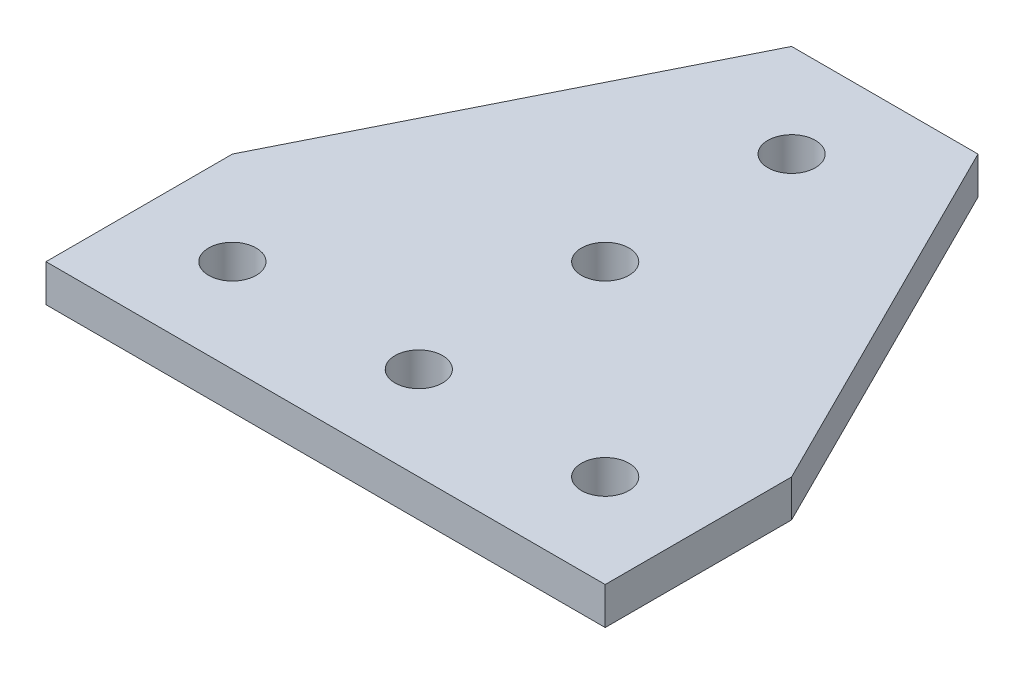
ISO-10303-21;
HEADER;
FILE_DESCRIPTION(('STEP AP214'),'2;1');
FILE_NAME('part.step','',(''),(''),'','','');
FILE_SCHEMA(('AUTOMOTIVE_DESIGN { 1 0 10303 214 1 1 1 1 }'));
ENDSEC;
DATA;
#1=APPLICATION_CONTEXT('core data for automotive mechanical design processes');
#2=APPLICATION_PROTOCOL_DEFINITION('international standard','automotive_design',2000,#1);
#3=PRODUCT_CONTEXT('',#1,'mechanical');
#4=PRODUCT('Part','Part','',(#3));
#5=PRODUCT_RELATED_PRODUCT_CATEGORY('part','',(#4));
#6=PRODUCT_DEFINITION_FORMATION('','',#4);
#7=PRODUCT_DEFINITION_CONTEXT('part definition',#1,'design');
#8=PRODUCT_DEFINITION('design','',#6,#7);
#9=PRODUCT_DEFINITION_SHAPE('','',#8);
#10=(LENGTH_UNIT() NAMED_UNIT(*) SI_UNIT(.MILLI.,.METRE.));
#11=(NAMED_UNIT(*) PLANE_ANGLE_UNIT() SI_UNIT($,.RADIAN.));
#12=(NAMED_UNIT(*) SI_UNIT($,.STERADIAN.) SOLID_ANGLE_UNIT());
#13=UNCERTAINTY_MEASURE_WITH_UNIT(LENGTH_MEASURE(1.E-05),#10,'distance_accuracy_value','');
#14=(GEOMETRIC_REPRESENTATION_CONTEXT(3) GLOBAL_UNCERTAINTY_ASSIGNED_CONTEXT((#13)) GLOBAL_UNIT_ASSIGNED_CONTEXT((#10,
#11,#12)) REPRESENTATION_CONTEXT('',''));
#15=CARTESIAN_POINT('',(0.,0.,0.));
#16=DIRECTION('',(0.,0.,1.));
#17=DIRECTION('',(1.,0.,0.));
#18=AXIS2_PLACEMENT_3D('',#15,#16,#17);
#19=CARTESIAN_POINT('',(0.,4.,0.));
#20=DIRECTION('',(0.,-1.,0.));
#21=DIRECTION('',(0.,0.,-1.));
#22=AXIS2_PLACEMENT_3D('',#19,#20,#21);
#23=PLANE('',#22);
#24=CARTESIAN_POINT('',(0.,4.,-20.));
#25=DIRECTION('',(0.,1.,0.));
#26=DIRECTION('',(0.,0.,1.));
#27=AXIS2_PLACEMENT_3D('',#24,#25,#26);
#28=CIRCLE('',#27,2.55);
#29=CARTESIAN_POINT('',(0.,4.,-17.45));
#30=VERTEX_POINT('',#29);
#31=EDGE_CURVE('E195',#30,#30,#28,.T.);
#32=ORIENTED_EDGE('',*,*,#31,.F.);
#33=EDGE_LOOP('',(#32));
#34=FACE_BOUND('',#33,.T.);
#35=CARTESIAN_POINT('',(20.,4.,0.));
#36=DIRECTION('',(0.,1.,0.));
#37=DIRECTION('',(0.,0.,1.));
#38=AXIS2_PLACEMENT_3D('',#35,#36,#37);
#39=CIRCLE('',#38,2.55);
#40=CARTESIAN_POINT('',(20.,4.,2.55));
#41=VERTEX_POINT('',#40);
#42=EDGE_CURVE('E207',#41,#41,#39,.T.);
#43=ORIENTED_EDGE('',*,*,#42,.F.);
#44=EDGE_LOOP('',(#43));
#45=FACE_BOUND('',#44,.T.);
#46=DIRECTION('',(0.,0.,-1.));
#47=VECTOR('',#46,1.);
#48=CARTESIAN_POINT('',(30.,4.,10.));
#49=LINE('',#48,#47);
#50=CARTESIAN_POINT('',(30.,4.,10.));
#51=VERTEX_POINT('',#50);
#52=CARTESIAN_POINT('',(30.,4.,-10.));
#53=VERTEX_POINT('',#52);
#54=EDGE_CURVE('E130',#51,#53,#49,.T.);
#55=ORIENTED_EDGE('',*,*,#54,.T.);
#56=DIRECTION('',(-0.447213595499958,0.,-0.894427190999916));
#57=VECTOR('',#56,1.);
#58=CARTESIAN_POINT('',(30.,4.,-10.));
#59=LINE('',#58,#57);
#60=CARTESIAN_POINT('',(10.,4.,-50.));
#61=VERTEX_POINT('',#60);
#62=EDGE_CURVE('E88',#53,#61,#59,.T.);
#63=ORIENTED_EDGE('',*,*,#62,.T.);
#64=DIRECTION('',(-1.,0.,0.));
#65=VECTOR('',#64,1.);
#66=CARTESIAN_POINT('',(-10.,4.,-50.));
#67=LINE('',#66,#65);
#68=CARTESIAN_POINT('',(-10.,4.,-50.));
#69=VERTEX_POINT('',#68);
#70=EDGE_CURVE('E101',#61,#69,#67,.T.);
#71=ORIENTED_EDGE('',*,*,#70,.T.);
#72=DIRECTION('',(-0.447213595499958,0.,0.894427190999916));
#73=VECTOR('',#72,1.);
#74=CARTESIAN_POINT('',(-30.,4.,-10.));
#75=LINE('',#74,#73);
#76=CARTESIAN_POINT('',(-30.,4.,-10.));
#77=VERTEX_POINT('',#76);
#78=EDGE_CURVE('E95',#69,#77,#75,.T.);
#79=ORIENTED_EDGE('',*,*,#78,.T.);
#80=DIRECTION('',(0.,0.,1.));
#81=VECTOR('',#80,1.);
#82=CARTESIAN_POINT('',(-30.,4.,10.));
#83=LINE('',#82,#81);
#84=CARTESIAN_POINT('',(-30.,4.,10.));
#85=VERTEX_POINT('',#84);
#86=EDGE_CURVE('E99',#77,#85,#83,.T.);
#87=ORIENTED_EDGE('',*,*,#86,.T.);
#88=DIRECTION('',(1.,0.,0.));
#89=VECTOR('',#88,1.);
#90=CARTESIAN_POINT('',(30.,4.,10.));
#91=LINE('',#90,#89);
#92=EDGE_CURVE('E51',#85,#51,#91,.T.);
#93=ORIENTED_EDGE('',*,*,#92,.T.);
#94=EDGE_LOOP('',(#55,#63,#71,#79,#87,#93));
#95=FACE_BOUND('',#94,.T.);
#96=CARTESIAN_POINT('',(-20.,4.,1.39659253553725E-13));
#97=DIRECTION('',(0.,1.,0.));
#98=DIRECTION('',(0.,0.,1.));
#99=AXIS2_PLACEMENT_3D('',#96,#97,#98);
#100=CIRCLE('',#99,2.55);
#101=CARTESIAN_POINT('',(-20.,4.,2.55000000000014));
#102=VERTEX_POINT('',#101);
#103=EDGE_CURVE('E123',#102,#102,#100,.T.);
#104=ORIENTED_EDGE('',*,*,#103,.F.);
#105=EDGE_LOOP('',(#104));
#106=FACE_BOUND('',#105,.T.);
#107=CARTESIAN_POINT('',(0.,4.,0.));
#108=DIRECTION('',(0.,1.,0.));
#109=DIRECTION('',(0.,0.,1.));
#110=AXIS2_PLACEMENT_3D('',#107,#108,#109);
#111=CIRCLE('',#110,2.55);
#112=CARTESIAN_POINT('',(0.,4.,2.55));
#113=VERTEX_POINT('',#112);
#114=EDGE_CURVE('E201',#113,#113,#111,.T.);
#115=ORIENTED_EDGE('',*,*,#114,.F.);
#116=EDGE_LOOP('',(#115));
#117=FACE_BOUND('',#116,.T.);
#118=CARTESIAN_POINT('',(-1.39693134871616E-13,4.,-40.));
#119=DIRECTION('',(0.,1.,0.));
#120=DIRECTION('',(0.,0.,1.));
#121=AXIS2_PLACEMENT_3D('',#118,#119,#120);
#122=CIRCLE('',#121,2.55);
#123=CARTESIAN_POINT('',(-1.39693134871616E-13,4.,-37.45));
#124=VERTEX_POINT('',#123);
#125=EDGE_CURVE('E186',#124,#124,#122,.T.);
#126=ORIENTED_EDGE('',*,*,#125,.F.);
#127=EDGE_LOOP('',(#126));
#128=FACE_BOUND('',#127,.T.);
#129=ADVANCED_FACE('F34',(#34,#45,#95,#106,#117,#128),#23,.F.);
#130=CARTESIAN_POINT('',(0.,0.,0.));
#131=DIRECTION('',(0.,-1.,0.));
#132=DIRECTION('',(0.,0.,-1.));
#133=AXIS2_PLACEMENT_3D('',#130,#131,#132);
#134=PLANE('',#133);
#135=CARTESIAN_POINT('',(0.,0.,-20.));
#136=DIRECTION('',(0.,1.,0.));
#137=DIRECTION('',(0.,0.,1.));
#138=AXIS2_PLACEMENT_3D('',#135,#136,#137);
#139=CIRCLE('',#138,2.55);
#140=CARTESIAN_POINT('',(0.,0.,-17.45));
#141=VERTEX_POINT('',#140);
#142=EDGE_CURVE('E192',#141,#141,#139,.T.);
#143=ORIENTED_EDGE('',*,*,#142,.T.);
#144=EDGE_LOOP('',(#143));
#145=FACE_BOUND('',#144,.T.);
#146=CARTESIAN_POINT('',(20.,0.,0.));
#147=DIRECTION('',(0.,1.,0.));
#148=DIRECTION('',(0.,0.,1.));
#149=AXIS2_PLACEMENT_3D('',#146,#147,#148);
#150=CIRCLE('',#149,2.55);
#151=CARTESIAN_POINT('',(20.,0.,2.55));
#152=VERTEX_POINT('',#151);
#153=EDGE_CURVE('E204',#152,#152,#150,.T.);
#154=ORIENTED_EDGE('',*,*,#153,.T.);
#155=EDGE_LOOP('',(#154));
#156=FACE_BOUND('',#155,.T.);
#157=DIRECTION('',(0.,0.,-1.));
#158=VECTOR('',#157,1.);
#159=CARTESIAN_POINT('',(30.,0.,10.));
#160=LINE('',#159,#158);
#161=CARTESIAN_POINT('',(30.,0.,10.));
#162=VERTEX_POINT('',#161);
#163=CARTESIAN_POINT('',(30.,0.,-10.));
#164=VERTEX_POINT('',#163);
#165=EDGE_CURVE('E119',#162,#164,#160,.T.);
#166=ORIENTED_EDGE('',*,*,#165,.F.);
#167=DIRECTION('',(1.,0.,0.));
#168=VECTOR('',#167,1.);
#169=CARTESIAN_POINT('',(30.,0.,10.));
#170=LINE('',#169,#168);
#171=CARTESIAN_POINT('',(-30.,0.,10.));
#172=VERTEX_POINT('',#171);
#173=EDGE_CURVE('E80',#172,#162,#170,.T.);
#174=ORIENTED_EDGE('',*,*,#173,.F.);
#175=DIRECTION('',(0.,0.,1.));
#176=VECTOR('',#175,1.);
#177=CARTESIAN_POINT('',(-30.,0.,10.));
#178=LINE('',#177,#176);
#179=CARTESIAN_POINT('',(-30.,0.,-10.));
#180=VERTEX_POINT('',#179);
#181=EDGE_CURVE('E74',#180,#172,#178,.T.);
#182=ORIENTED_EDGE('',*,*,#181,.F.);
#183=DIRECTION('',(-0.447213595499958,0.,0.894427190999916));
#184=VECTOR('',#183,1.);
#185=CARTESIAN_POINT('',(-30.,0.,-10.));
#186=LINE('',#185,#184);
#187=CARTESIAN_POINT('',(-10.,0.,-50.));
#188=VERTEX_POINT('',#187);
#189=EDGE_CURVE('E109',#188,#180,#186,.T.);
#190=ORIENTED_EDGE('',*,*,#189,.F.);
#191=DIRECTION('',(-1.,0.,0.));
#192=VECTOR('',#191,1.);
#193=CARTESIAN_POINT('',(-10.,0.,-50.));
#194=LINE('',#193,#192);
#195=CARTESIAN_POINT('',(10.,0.,-50.));
#196=VERTEX_POINT('',#195);
#197=EDGE_CURVE('E125',#196,#188,#194,.T.);
#198=ORIENTED_EDGE('',*,*,#197,.F.);
#199=DIRECTION('',(-0.447213595499958,0.,-0.894427190999916));
#200=VECTOR('',#199,1.);
#201=CARTESIAN_POINT('',(30.,0.,-10.));
#202=LINE('',#201,#200);
#203=EDGE_CURVE('E122',#164,#196,#202,.T.);
#204=ORIENTED_EDGE('',*,*,#203,.F.);
#205=EDGE_LOOP('',(#166,#174,#182,#190,#198,#204));
#206=FACE_BOUND('',#205,.T.);
#207=CARTESIAN_POINT('',(-20.,0.,1.39659253553725E-13));
#208=DIRECTION('',(0.,1.,0.));
#209=DIRECTION('',(0.,0.,1.));
#210=AXIS2_PLACEMENT_3D('',#207,#208,#209);
#211=CIRCLE('',#210,2.55);
#212=CARTESIAN_POINT('',(-20.,0.,2.55000000000014));
#213=VERTEX_POINT('',#212);
#214=EDGE_CURVE('E210',#213,#213,#211,.T.);
#215=ORIENTED_EDGE('',*,*,#214,.T.);
#216=EDGE_LOOP('',(#215));
#217=FACE_BOUND('',#216,.T.);
#218=CARTESIAN_POINT('',(0.,0.,0.));
#219=DIRECTION('',(0.,1.,0.));
#220=DIRECTION('',(0.,0.,1.));
#221=AXIS2_PLACEMENT_3D('',#218,#219,#220);
#222=CIRCLE('',#221,2.55);
#223=CARTESIAN_POINT('',(0.,0.,2.55));
#224=VERTEX_POINT('',#223);
#225=EDGE_CURVE('E198',#224,#224,#222,.T.);
#226=ORIENTED_EDGE('',*,*,#225,.T.);
#227=EDGE_LOOP('',(#226));
#228=FACE_BOUND('',#227,.T.);
#229=CARTESIAN_POINT('',(-1.39693134871616E-13,0.,-40.));
#230=DIRECTION('',(0.,1.,0.));
#231=DIRECTION('',(0.,0.,1.));
#232=AXIS2_PLACEMENT_3D('',#229,#230,#231);
#233=CIRCLE('',#232,2.55);
#234=CARTESIAN_POINT('',(-1.39693134871616E-13,0.,-37.45));
#235=VERTEX_POINT('',#234);
#236=EDGE_CURVE('E189',#235,#235,#233,.T.);
#237=ORIENTED_EDGE('',*,*,#236,.T.);
#238=EDGE_LOOP('',(#237));
#239=FACE_BOUND('',#238,.T.);
#240=ADVANCED_FACE('F139',(#145,#156,#206,#217,#228,#239),#134,.T.);
#241=CARTESIAN_POINT('',(30.,4.,10.));
#242=DIRECTION('',(-1.,0.,0.));
#243=DIRECTION('',(0.,0.,1.));
#244=AXIS2_PLACEMENT_3D('',#241,#242,#243);
#245=PLANE('',#244);
#246=ORIENTED_EDGE('',*,*,#165,.T.);
#247=DIRECTION('',(0.,-1.,0.));
#248=VECTOR('',#247,1.);
#249=CARTESIAN_POINT('',(30.,4.,-10.));
#250=LINE('',#249,#248);
#251=EDGE_CURVE('E11',#53,#164,#250,.T.);
#252=ORIENTED_EDGE('',*,*,#251,.F.);
#253=ORIENTED_EDGE('',*,*,#54,.F.);
#254=DIRECTION('',(0.,-1.,0.));
#255=VECTOR('',#254,1.);
#256=CARTESIAN_POINT('',(30.,4.,10.));
#257=LINE('',#256,#255);
#258=EDGE_CURVE('E115',#51,#162,#257,.T.);
#259=ORIENTED_EDGE('',*,*,#258,.T.);
#260=EDGE_LOOP('',(#246,#252,#253,#259));
#261=FACE_BOUND('',#260,.T.);
#262=ADVANCED_FACE('F36',(#261),#245,.F.);
#263=CARTESIAN_POINT('',(30.,4.,-10.));
#264=DIRECTION('',(-0.894427190999916,0.,0.447213595499958));
#265=DIRECTION('',(0.447213595499958,0.,0.894427190999916));
#266=AXIS2_PLACEMENT_3D('',#263,#264,#265);
#267=PLANE('',#266);
#268=ORIENTED_EDGE('',*,*,#203,.T.);
#269=DIRECTION('',(0.,-1.,0.));
#270=VECTOR('',#269,1.);
#271=CARTESIAN_POINT('',(10.,4.,-50.));
#272=LINE('',#271,#270);
#273=EDGE_CURVE('E43',#61,#196,#272,.T.);
#274=ORIENTED_EDGE('',*,*,#273,.F.);
#275=ORIENTED_EDGE('',*,*,#62,.F.);
#276=ORIENTED_EDGE('',*,*,#251,.T.);
#277=EDGE_LOOP('',(#268,#274,#275,#276));
#278=FACE_BOUND('',#277,.T.);
#279=ADVANCED_FACE('F276',(#278),#267,.F.);
#280=CARTESIAN_POINT('',(-10.,4.,-50.));
#281=DIRECTION('',(0.,0.,1.));
#282=DIRECTION('',(1.,0.,0.));
#283=AXIS2_PLACEMENT_3D('',#280,#281,#282);
#284=PLANE('',#283);
#285=ORIENTED_EDGE('',*,*,#197,.T.);
#286=DIRECTION('',(0.,-1.,0.));
#287=VECTOR('',#286,1.);
#288=CARTESIAN_POINT('',(-10.,4.,-50.));
#289=LINE('',#288,#287);
#290=EDGE_CURVE('E110',#69,#188,#289,.T.);
#291=ORIENTED_EDGE('',*,*,#290,.F.);
#292=ORIENTED_EDGE('',*,*,#70,.F.);
#293=ORIENTED_EDGE('',*,*,#273,.T.);
#294=EDGE_LOOP('',(#285,#291,#292,#293));
#295=FACE_BOUND('',#294,.T.);
#296=ADVANCED_FACE('F136',(#295),#284,.F.);
#297=CARTESIAN_POINT('',(-30.,4.,-10.));
#298=DIRECTION('',(0.894427190999916,0.,0.447213595499958));
#299=DIRECTION('',(0.447213595499958,0.,-0.894427190999916));
#300=AXIS2_PLACEMENT_3D('',#297,#298,#299);
#301=PLANE('',#300);
#302=ORIENTED_EDGE('',*,*,#189,.T.);
#303=DIRECTION('',(0.,-1.,0.));
#304=VECTOR('',#303,1.);
#305=CARTESIAN_POINT('',(-30.,4.,-10.));
#306=LINE('',#305,#304);
#307=EDGE_CURVE('E106',#77,#180,#306,.T.);
#308=ORIENTED_EDGE('',*,*,#307,.F.);
#309=ORIENTED_EDGE('',*,*,#78,.F.);
#310=ORIENTED_EDGE('',*,*,#290,.T.);
#311=EDGE_LOOP('',(#302,#308,#309,#310));
#312=FACE_BOUND('',#311,.T.);
#313=ADVANCED_FACE('F107',(#312),#301,.F.);
#314=CARTESIAN_POINT('',(-30.,4.,10.));
#315=DIRECTION('',(1.,0.,0.));
#316=DIRECTION('',(0.,0.,-1.));
#317=AXIS2_PLACEMENT_3D('',#314,#315,#316);
#318=PLANE('',#317);
#319=ORIENTED_EDGE('',*,*,#181,.T.);
#320=DIRECTION('',(0.,-1.,0.));
#321=VECTOR('',#320,1.);
#322=CARTESIAN_POINT('',(-30.,4.,10.));
#323=LINE('',#322,#321);
#324=EDGE_CURVE('E111',#85,#172,#323,.T.);
#325=ORIENTED_EDGE('',*,*,#324,.F.);
#326=ORIENTED_EDGE('',*,*,#86,.F.);
#327=ORIENTED_EDGE('',*,*,#307,.T.);
#328=EDGE_LOOP('',(#319,#325,#326,#327));
#329=FACE_BOUND('',#328,.T.);
#330=ADVANCED_FACE('F113',(#329),#318,.F.);
#331=CARTESIAN_POINT('',(30.,4.,10.));
#332=DIRECTION('',(0.,0.,-1.));
#333=DIRECTION('',(-1.,0.,0.));
#334=AXIS2_PLACEMENT_3D('',#331,#332,#333);
#335=PLANE('',#334);
#336=ORIENTED_EDGE('',*,*,#173,.T.);
#337=ORIENTED_EDGE('',*,*,#258,.F.);
#338=ORIENTED_EDGE('',*,*,#92,.F.);
#339=ORIENTED_EDGE('',*,*,#324,.T.);
#340=EDGE_LOOP('',(#336,#337,#338,#339));
#341=FACE_BOUND('',#340,.T.);
#342=ADVANCED_FACE('F144',(#341),#335,.F.);
#343=CARTESIAN_POINT('',(-20.,4.,1.39659253553725E-13));
#344=DIRECTION('',(0.,-1.,0.));
#345=DIRECTION('',(0.,0.,-1.));
#346=AXIS2_PLACEMENT_3D('',#343,#344,#345);
#347=CYLINDRICAL_SURFACE('',#346,2.55);
#348=ORIENTED_EDGE('',*,*,#103,.T.);
#349=EDGE_LOOP('',(#348));
#350=FACE_BOUND('',#349,.T.);
#351=ORIENTED_EDGE('',*,*,#214,.F.);
#352=EDGE_LOOP('',(#351));
#353=FACE_BOUND('',#352,.T.);
#354=ADVANCED_FACE('F146',(#350,#353),#347,.F.);
#355=CARTESIAN_POINT('',(20.,4.,0.));
#356=DIRECTION('',(0.,-1.,0.));
#357=DIRECTION('',(0.,0.,-1.));
#358=AXIS2_PLACEMENT_3D('',#355,#356,#357);
#359=CYLINDRICAL_SURFACE('',#358,2.55);
#360=ORIENTED_EDGE('',*,*,#42,.T.);
#361=EDGE_LOOP('',(#360));
#362=FACE_BOUND('',#361,.T.);
#363=ORIENTED_EDGE('',*,*,#153,.F.);
#364=EDGE_LOOP('',(#363));
#365=FACE_BOUND('',#364,.T.);
#366=ADVANCED_FACE('F152',(#362,#365),#359,.F.);
#367=CARTESIAN_POINT('',(0.,4.,0.));
#368=DIRECTION('',(0.,-1.,0.));
#369=DIRECTION('',(0.,0.,-1.));
#370=AXIS2_PLACEMENT_3D('',#367,#368,#369);
#371=CYLINDRICAL_SURFACE('',#370,2.55);
#372=ORIENTED_EDGE('',*,*,#114,.T.);
#373=EDGE_LOOP('',(#372));
#374=FACE_BOUND('',#373,.T.);
#375=ORIENTED_EDGE('',*,*,#225,.F.);
#376=EDGE_LOOP('',(#375));
#377=FACE_BOUND('',#376,.T.);
#378=ADVANCED_FACE('F169',(#374,#377),#371,.F.);
#379=CARTESIAN_POINT('',(0.,4.,-20.));
#380=DIRECTION('',(0.,-1.,0.));
#381=DIRECTION('',(0.,0.,-1.));
#382=AXIS2_PLACEMENT_3D('',#379,#380,#381);
#383=CYLINDRICAL_SURFACE('',#382,2.55);
#384=ORIENTED_EDGE('',*,*,#31,.T.);
#385=EDGE_LOOP('',(#384));
#386=FACE_BOUND('',#385,.T.);
#387=ORIENTED_EDGE('',*,*,#142,.F.);
#388=EDGE_LOOP('',(#387));
#389=FACE_BOUND('',#388,.T.);
#390=ADVANCED_FACE('F173',(#386,#389),#383,.F.);
#391=CARTESIAN_POINT('',(-1.39693134871616E-13,4.,-40.));
#392=DIRECTION('',(0.,-1.,0.));
#393=DIRECTION('',(0.,0.,-1.));
#394=AXIS2_PLACEMENT_3D('',#391,#392,#393);
#395=CYLINDRICAL_SURFACE('',#394,2.55);
#396=ORIENTED_EDGE('',*,*,#125,.T.);
#397=EDGE_LOOP('',(#396));
#398=FACE_BOUND('',#397,.T.);
#399=ORIENTED_EDGE('',*,*,#236,.F.);
#400=EDGE_LOOP('',(#399));
#401=FACE_BOUND('',#400,.T.);
#402=ADVANCED_FACE('F177',(#398,#401),#395,.F.);
#403=CLOSED_SHELL('',(#129,#240,#262,#279,#296,#313,#330,#342,#354,#366,#378,#390,#402));
#404=MANIFOLD_SOLID_BREP('B2',#403);
#405=ADVANCED_BREP_SHAPE_REPRESENTATION('',(#18,#404),#14);
#406=SHAPE_DEFINITION_REPRESENTATION(#9,#405);
ENDSEC;
END-ISO-10303-21;
